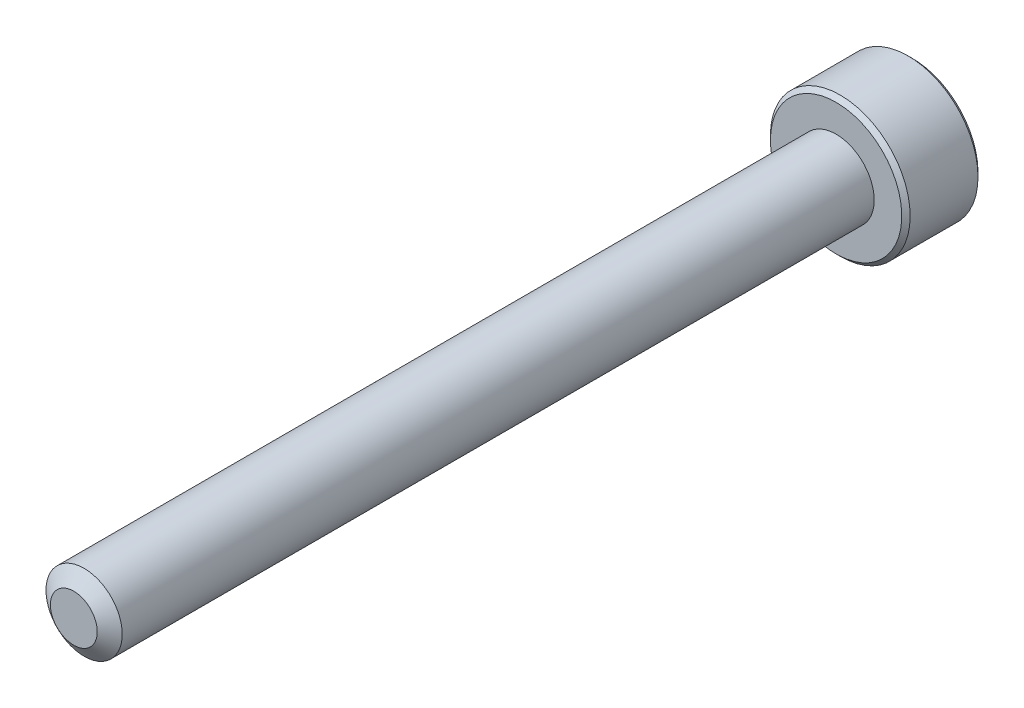
ISO-10303-21;
HEADER;
FILE_DESCRIPTION(('STEP AP214'),'2;1');
FILE_NAME('part.step','',(''),(''),'','','');
FILE_SCHEMA(('AUTOMOTIVE_DESIGN { 1 0 10303 214 1 1 1 1 }'));
ENDSEC;
DATA;
#1=APPLICATION_CONTEXT('core data for automotive mechanical design processes');
#2=APPLICATION_PROTOCOL_DEFINITION('international standard','automotive_design',2000,#1);
#3=PRODUCT_CONTEXT('',#1,'mechanical');
#4=PRODUCT('Part','Part','',(#3));
#5=PRODUCT_RELATED_PRODUCT_CATEGORY('part','',(#4));
#6=PRODUCT_DEFINITION_FORMATION('','',#4);
#7=PRODUCT_DEFINITION_CONTEXT('part definition',#1,'design');
#8=PRODUCT_DEFINITION('design','',#6,#7);
#9=PRODUCT_DEFINITION_SHAPE('','',#8);
#10=(LENGTH_UNIT() NAMED_UNIT(*) SI_UNIT(.MILLI.,.METRE.));
#11=(NAMED_UNIT(*) PLANE_ANGLE_UNIT() SI_UNIT($,.RADIAN.));
#12=(NAMED_UNIT(*) SI_UNIT($,.STERADIAN.) SOLID_ANGLE_UNIT());
#13=UNCERTAINTY_MEASURE_WITH_UNIT(LENGTH_MEASURE(1.E-05),#10,'distance_accuracy_value','');
#14=(GEOMETRIC_REPRESENTATION_CONTEXT(3) GLOBAL_UNCERTAINTY_ASSIGNED_CONTEXT((#13)) GLOBAL_UNIT_ASSIGNED_CONTEXT((#10,
#11,#12)) REPRESENTATION_CONTEXT('',''));
#15=CARTESIAN_POINT('',(0.,0.,0.));
#16=DIRECTION('',(0.,0.,1.));
#17=DIRECTION('',(1.,0.,0.));
#18=AXIS2_PLACEMENT_3D('',#15,#16,#17);
#19=CARTESIAN_POINT('',(0.,-1.44337567297406,-31.125));
#20=DIRECTION('',(-0.5,-0.866025403784439,0.));
#21=DIRECTION('',(0.866025403784439,-0.5,0.));
#22=AXIS2_PLACEMENT_3D('',#19,#20,#21);
#23=PLANE('',#22);
#24=CARTESIAN_POINT('',(-1.24999999999719,-0.721687836488653,-33.0000000000106));
#25=CARTESIAN_POINT('',(-1.20703689149334,-0.746492598748569,-32.9752190397288));
#26=CARTESIAN_POINT('',(-1.16335543595188,-0.771712098864028,-32.9518937494737));
#27=CARTESIAN_POINT('',(-1.07428446543455,-0.823137247669188,-32.9091861389212));
#28=CARTESIAN_POINT('',(-1.02888648443341,-0.849347784220863,-32.8898275733605));
#29=CARTESIAN_POINT('',(-0.937343688520915,-0.902200042083313,-32.8566662159147));
#30=CARTESIAN_POINT('',(-0.891222174140705,-0.928828310826161,-32.8427800967852));
#31=CARTESIAN_POINT('',(-0.79796403889092,-0.982670920316747,-32.8213859018018));
#32=CARTESIAN_POINT('',(-0.750830264933392,-1.00988361739905,-32.8138618619237));
#33=CARTESIAN_POINT('',(-0.669590913521733,-1.05678717880536,-32.8070728277984));
#34=CARTESIAN_POINT('',(-0.635590177984294,-1.07641751262055,-32.8060681886569));
#35=CARTESIAN_POINT('',(-0.567648554675317,-1.11564362712716,-32.8077634952234));
#36=CARTESIAN_POINT('',(-0.533707681782074,-1.13523939922861,-32.8104642592638));
#37=CARTESIAN_POINT('',(-0.466153619735585,-1.174241755136,-32.8194142483472));
#38=CARTESIAN_POINT('',(-0.432540764897262,-1.19364814592514,-32.8256667730595));
#39=CARTESIAN_POINT('',(-0.365876260757552,-1.23213691533559,-32.8413835392478));
#40=CARTESIAN_POINT('',(-0.332824858668373,-1.25121915122888,-32.8508491588607));
#41=CARTESIAN_POINT('',(-0.248213569936039,-1.30006950155497,-32.8789283315822));
#42=CARTESIAN_POINT('',(-0.197186124432403,-1.32953021095255,-32.8996493450655));
#43=CARTESIAN_POINT('',(-0.0971276056231052,-1.38729902372182,-32.9463235058209));
#44=CARTESIAN_POINT('',(-0.0480906425397016,-1.41561052755826,-32.9722596212326));
#45=CARTESIAN_POINT('',(-2.80957824535407E-12,-1.44337567297244,-33.0000000000106));
#46=B_SPLINE_CURVE_WITH_KNOTS('',3,(#24,#25,#26,#27,#28,#29,#30,#31,#32,#33,#34,#35,#36,#37,#38,
#39,#40,#41,#42,#43,#44,#45),.UNSPECIFIED.,.F.,.F.,(4,2,2,2,2,2,2,2,2,2,4),(0.,
0.166478683225078,0.333926926831281,0.498716658516144,0.663091654625516,0.780745575557468,
0.898425484350478,1.01621489976922,1.13405490052337,1.32111591641063,1.50757565757894),.UNSPECIFIED.);
#47=CARTESIAN_POINT('',(-1.25000000000136,-0.721687836486245,-33.0000000000131));
#48=VERTEX_POINT('',#47);
#49=CARTESIAN_POINT('',(-4.16671953249464E-12,-1.44337567297485,-33.0000000000131));
#50=VERTEX_POINT('',#49);
#51=EDGE_CURVE('E21',#48,#50,#46,.T.);
#52=ORIENTED_EDGE('',*,*,#51,.F.);
#53=DIRECTION('',(0.,0.,1.));
#54=VECTOR('',#53,1.);
#55=CARTESIAN_POINT('',(-1.25,-0.721687836487032,-31.125));
#56=LINE('',#55,#54);
#57=CARTESIAN_POINT('',(-1.25,-0.721687836487031,-31.125));
#58=VERTEX_POINT('',#57);
#59=EDGE_CURVE('E104',#48,#58,#56,.T.);
#60=ORIENTED_EDGE('',*,*,#59,.T.);
#61=DIRECTION('',(0.866025403784439,-0.5,0.));
#62=VECTOR('',#61,1.);
#63=CARTESIAN_POINT('',(0.,-1.44337567297406,-31.125));
#64=LINE('',#63,#62);
#65=CARTESIAN_POINT('',(0.,-1.44337567297406,-31.125));
#66=VERTEX_POINT('',#65);
#67=EDGE_CURVE('E77',#66,#58,#64,.F.);
#68=ORIENTED_EDGE('',*,*,#67,.F.);
#69=DIRECTION('',(0.,0.,1.));
#70=VECTOR('',#69,1.);
#71=CARTESIAN_POINT('',(0.,-1.44337567297406,-31.125));
#72=LINE('',#71,#70);
#73=EDGE_CURVE('E76',#66,#50,#72,.F.);
#74=ORIENTED_EDGE('',*,*,#73,.T.);
#75=EDGE_LOOP('',(#52,#60,#68,#74));
#76=FACE_BOUND('',#75,.T.);
#77=ADVANCED_FACE('F17',(#76),#23,.F.);
#78=CARTESIAN_POINT('',(1.25,-0.721687836487033,-31.125));
#79=DIRECTION('',(0.5,-0.866025403784439,0.));
#80=DIRECTION('',(0.866025403784439,0.5,0.));
#81=AXIS2_PLACEMENT_3D('',#78,#79,#80);
#82=PLANE('',#81);
#83=CARTESIAN_POINT('',(2.81411783743714E-12,-1.44337567297244,-33.0000000000106));
#84=CARTESIAN_POINT('',(0.0429631085066566,-1.41857091071252,-32.9752190397288));
#85=CARTESIAN_POINT('',(0.0866445640481205,-1.39335141059707,-32.9518937494737));
#86=CARTESIAN_POINT('',(0.175715534565449,-1.3419262617919,-32.9091861389212));
#87=CARTESIAN_POINT('',(0.221113515566591,-1.31571572524023,-32.8898275733605));
#88=CARTESIAN_POINT('',(0.312656311479088,-1.26286346737778,-32.8566662159147));
#89=CARTESIAN_POINT('',(0.358777825859299,-1.23623519863493,-32.8427800967852));
#90=CARTESIAN_POINT('',(0.452035961109083,-1.18239258914434,-32.8213859018018));
#91=CARTESIAN_POINT('',(0.49916973506661,-1.15517989206204,-32.8138618619237));
#92=CARTESIAN_POINT('',(0.58040908647827,-1.10827633065573,-32.8070728277984));
#93=CARTESIAN_POINT('',(0.614409822015708,-1.08864599684055,-32.8060681886569));
#94=CARTESIAN_POINT('',(0.682351445324686,-1.04941988233393,-32.8077634952234));
#95=CARTESIAN_POINT('',(0.716292318217928,-1.02982411023248,-32.8104642592638));
#96=CARTESIAN_POINT('',(0.783846380264418,-0.99082175432509,-32.8194142483472));
#97=CARTESIAN_POINT('',(0.817459235102742,-0.971415363535952,-32.8256667730595));
#98=CARTESIAN_POINT('',(0.884123739242452,-0.932926594125497,-32.8413835392478));
#99=CARTESIAN_POINT('',(0.91717514133163,-0.913844358232215,-32.8508491588607));
#100=CARTESIAN_POINT('',(1.00178643006396,-0.864994007906121,-32.8789283315822));
#101=CARTESIAN_POINT('',(1.0528138755676,-0.835533298508539,-32.8996493450655));
#102=CARTESIAN_POINT('',(1.15287239437689,-0.777764485739277,-32.9463235058209));
#103=CARTESIAN_POINT('',(1.2019093574603,-0.749452981902834,-32.9722596212326));
#104=CARTESIAN_POINT('',(1.24999999999719,-0.721687836488658,-33.0000000000106));
#105=B_SPLINE_CURVE_WITH_KNOTS('',3,(#83,#84,#85,#86,#87,#88,#89,#90,#91,#92,#93,#94,#95,#96,
#97,#98,#99,#100,#101,#102,#103,#104),.UNSPECIFIED.,.F.,.F.,(4,2,2,2,2,2,2,2,2,2,4),(0.,
0.166478683225079,0.333926926831284,0.498716658516146,0.663091654625518,0.78074557555747,
0.89842548435048,1.01621489976923,1.13405490052337,1.32111591641063,1.50757565757893),.UNSPECIFIED.);
#106=CARTESIAN_POINT('',(1.24999999999859,-0.721687836491034,-33.0000000000131));
#107=VERTEX_POINT('',#106);
#108=EDGE_CURVE('E84',#50,#107,#105,.T.);
#109=ORIENTED_EDGE('',*,*,#108,.F.);
#110=ORIENTED_EDGE('',*,*,#73,.F.);
#111=DIRECTION('',(-0.86602540378444,-0.499999999999997,0.));
#112=VECTOR('',#111,1.);
#113=CARTESIAN_POINT('',(1.25,-0.721687836487033,-31.125));
#114=LINE('',#113,#112);
#115=CARTESIAN_POINT('',(1.25,-0.721687836487033,-31.125));
#116=VERTEX_POINT('',#115);
#117=EDGE_CURVE('E272',#116,#66,#114,.T.);
#118=ORIENTED_EDGE('',*,*,#117,.F.);
#119=DIRECTION('',(0.,0.,-1.));
#120=VECTOR('',#119,1.);
#121=CARTESIAN_POINT('',(1.25,-0.721687836487033,-31.125));
#122=LINE('',#121,#120);
#123=EDGE_CURVE('E103',#116,#107,#122,.T.);
#124=ORIENTED_EDGE('',*,*,#123,.T.);
#125=EDGE_LOOP('',(#109,#110,#118,#124));
#126=FACE_BOUND('',#125,.T.);
#127=ADVANCED_FACE('F101',(#126),#82,.F.);
#128=CARTESIAN_POINT('',(-1.25,-0.721687836487032,-31.125));
#129=DIRECTION('',(-1.,0.,0.));
#130=DIRECTION('',(0.,-1.,0.));
#131=AXIS2_PLACEMENT_3D('',#128,#129,#130);
#132=PLANE('',#131);
#133=CARTESIAN_POINT('',(-1.25,0.721687836483783,-33.0000000000106));
#134=CARTESIAN_POINT('',(-1.25,0.672078311963948,-32.9752190397288));
#135=CARTESIAN_POINT('',(-1.25,0.621639311733029,-32.9518937494737));
#136=CARTESIAN_POINT('',(-1.25,0.518789014122708,-32.9091861389212));
#137=CARTESIAN_POINT('',(-1.25,0.46636794101936,-32.8898275733605));
#138=CARTESIAN_POINT('',(-1.25,0.360663425294459,-32.8566662159147));
#139=CARTESIAN_POINT('',(-1.25,0.307406887808763,-32.8427800967852));
#140=CARTESIAN_POINT('',(-1.25,0.199721668827592,-32.8213859018018));
#141=CARTESIAN_POINT('',(-1.25,0.145296274662989,-32.8138618619237));
#142=CARTESIAN_POINT('',(-1.25,0.0514891518503645,-32.8070728277984));
#143=CARTESIAN_POINT('',(-1.25,0.0122284842199936,-32.8060681886569));
#144=CARTESIAN_POINT('',(-1.25,-0.066223744793243,-32.8077634952234));
#145=CARTESIAN_POINT('',(-1.25,-0.105415288996132,-32.8104642592638));
#146=CARTESIAN_POINT('',(-1.25,-0.183420000810919,-32.8194142483472));
#147=CARTESIAN_POINT('',(-1.25,-0.222232782389194,-32.8256667730595));
#148=CARTESIAN_POINT('',(-1.25,-0.299210321210103,-32.8413835392478));
#149=CARTESIAN_POINT('',(-1.25,-0.337374792996667,-32.8508491588607));
#150=CARTESIAN_POINT('',(-1.25,-0.435075493648855,-32.8789283315822));
#151=CARTESIAN_POINT('',(-1.25,-0.493996912444021,-32.8996493450655));
#152=CARTESIAN_POINT('',(-1.25,-0.609534537982544,-32.9463235058209));
#153=CARTESIAN_POINT('',(-1.25,-0.666157545655431,-32.9722596212326));
#154=CARTESIAN_POINT('',(-1.25,-0.721687836483782,-33.0000000000106));
#155=B_SPLINE_CURVE_WITH_KNOTS('',3,(#133,#134,#135,#136,#137,#138,#139,#140,#141,#142,#143,
#144,#145,#146,#147,#148,#149,#150,#151,#152,#153,#154),.UNSPECIFIED.,.F.,.F.,(4,2,2,2,2,2,2,2,
2,2,4),(0.,0.166478683225082,0.333926926831283,0.498716658516146,0.663091654625519,
0.78074557555747,0.89842548435048,1.01621489976923,1.13405490052337,1.32111591641063,
1.50757565757893),.UNSPECIFIED.);
#156=CARTESIAN_POINT('',(-1.25,0.721687836488597,-33.0000000000131));
#157=VERTEX_POINT('',#156);
#158=EDGE_CURVE('E61',#157,#48,#155,.T.);
#159=ORIENTED_EDGE('',*,*,#158,.F.);
#160=DIRECTION('',(0.,0.,1.));
#161=VECTOR('',#160,1.);
#162=CARTESIAN_POINT('',(-1.25,0.721687836487032,-31.125));
#163=LINE('',#162,#161);
#164=CARTESIAN_POINT('',(-1.25,0.721687836487032,-31.125));
#165=VERTEX_POINT('',#164);
#166=EDGE_CURVE('E249',#157,#165,#163,.T.);
#167=ORIENTED_EDGE('',*,*,#166,.T.);
#168=DIRECTION('',(0.,1.,0.));
#169=VECTOR('',#168,1.);
#170=CARTESIAN_POINT('',(-1.25,2.1650635094611,-31.125));
#171=LINE('',#170,#169);
#172=EDGE_CURVE('E268',#58,#165,#171,.T.);
#173=ORIENTED_EDGE('',*,*,#172,.F.);
#174=ORIENTED_EDGE('',*,*,#59,.F.);
#175=EDGE_LOOP('',(#159,#167,#173,#174));
#176=FACE_BOUND('',#175,.T.);
#177=ADVANCED_FACE('F122',(#176),#132,.F.);
#178=CARTESIAN_POINT('',(1.25,2.1650635094611,-31.125));
#179=DIRECTION('',(0.,0.,-1.));
#180=DIRECTION('',(-1.,0.,0.));
#181=AXIS2_PLACEMENT_3D('',#178,#179,#180);
#182=PLANE('',#181);
#183=ORIENTED_EDGE('',*,*,#67,.T.);
#184=ORIENTED_EDGE('',*,*,#172,.T.);
#185=DIRECTION('',(-0.866025403784439,-0.5,0.));
#186=VECTOR('',#185,1.);
#187=CARTESIAN_POINT('',(-1.25,0.721687836487032,-31.125));
#188=LINE('',#187,#186);
#189=CARTESIAN_POINT('',(0.,1.44337567297406,-31.125));
#190=VERTEX_POINT('',#189);
#191=EDGE_CURVE('E144',#165,#190,#188,.F.);
#192=ORIENTED_EDGE('',*,*,#191,.T.);
#193=DIRECTION('',(-0.866025403784439,0.5,0.));
#194=VECTOR('',#193,1.);
#195=CARTESIAN_POINT('',(0.,1.44337567297406,-31.125));
#196=LINE('',#195,#194);
#197=CARTESIAN_POINT('',(1.25,0.721687836487029,-31.125));
#198=VERTEX_POINT('',#197);
#199=EDGE_CURVE('E246',#190,#198,#196,.F.);
#200=ORIENTED_EDGE('',*,*,#199,.T.);
#201=DIRECTION('',(0.,1.,0.));
#202=VECTOR('',#201,1.);
#203=CARTESIAN_POINT('',(1.25,0.721687836487032,-31.125));
#204=LINE('',#203,#202);
#205=EDGE_CURVE('E263',#198,#116,#204,.F.);
#206=ORIENTED_EDGE('',*,*,#205,.T.);
#207=ORIENTED_EDGE('',*,*,#117,.T.);
#208=EDGE_LOOP('',(#183,#184,#192,#200,#206,#207));
#209=FACE_BOUND('',#208,.T.);
#210=ADVANCED_FACE('F126',(#209),#182,.T.);
#211=CARTESIAN_POINT('',(1.25,0.721687836487032,-31.125));
#212=DIRECTION('',(1.,0.,0.));
#213=DIRECTION('',(0.,0.,-1.));
#214=AXIS2_PLACEMENT_3D('',#211,#212,#213);
#215=PLANE('',#214);
#216=CARTESIAN_POINT('',(1.25,-0.721687836483783,-33.0000000000106));
#217=CARTESIAN_POINT('',(1.25,-0.672078311963948,-32.9752190397288));
#218=CARTESIAN_POINT('',(1.25,-0.621639311733029,-32.9518937494737));
#219=CARTESIAN_POINT('',(1.25,-0.518789014122707,-32.9091861389212));
#220=CARTESIAN_POINT('',(1.25,-0.466367941019357,-32.8898275733605));
#221=CARTESIAN_POINT('',(1.25,-0.360663425294455,-32.8566662159147));
#222=CARTESIAN_POINT('',(1.25,-0.307406887808759,-32.8427800967852));
#223=CARTESIAN_POINT('',(1.25,-0.199721668827589,-32.8213859018018));
#224=CARTESIAN_POINT('',(1.25,-0.145296274662988,-32.8138618619237));
#225=CARTESIAN_POINT('',(1.25,-0.0514891518503652,-32.8070728277984));
#226=CARTESIAN_POINT('',(1.25,-0.0122284842199946,-32.8060681886569));
#227=CARTESIAN_POINT('',(1.25,0.0662237447932413,-32.8077634952234));
#228=CARTESIAN_POINT('',(1.25,0.10541528899613,-32.8104642592638));
#229=CARTESIAN_POINT('',(1.25,0.183420000810917,-32.8194142483472));
#230=CARTESIAN_POINT('',(1.25,0.222232782389193,-32.8256667730595));
#231=CARTESIAN_POINT('',(1.25,0.299210321210102,-32.8413835392478));
#232=CARTESIAN_POINT('',(1.25,0.337374792996666,-32.8508491588607));
#233=CARTESIAN_POINT('',(1.25,0.435075493649003,-32.8789283315822));
#234=CARTESIAN_POINT('',(1.25,0.493996912444312,-32.8996493450656));
#235=CARTESIAN_POINT('',(1.25,0.609534537983112,-32.9463235058211));
#236=CARTESIAN_POINT('',(1.25,0.666157545656132,-32.9722596212329));
#237=CARTESIAN_POINT('',(1.25,0.721687836484612,-33.0000000000111));
#238=B_SPLINE_CURVE_WITH_KNOTS('',3,(#216,#217,#218,#219,#220,#221,#222,#223,#224,#225,#226,
#227,#228,#229,#230,#231,#232,#233,#234,#235,#236,#237),.UNSPECIFIED.,.F.,.F.,(4,2,2,2,2,2,2,2,
2,2,4),(0.,0.166478683225082,0.333926926831288,0.498716658516149,0.663091654625518,
0.780745575557469,0.898425484350478,1.01621489976923,1.13405490052337,1.32111591641109,
1.50757565757986),.UNSPECIFIED.);
#239=CARTESIAN_POINT('',(1.25000000000033,0.721687836488433,-33.0000000000133));
#240=VERTEX_POINT('',#239);
#241=EDGE_CURVE('E40',#107,#240,#238,.T.);
#242=ORIENTED_EDGE('',*,*,#241,.F.);
#243=ORIENTED_EDGE('',*,*,#123,.F.);
#244=ORIENTED_EDGE('',*,*,#205,.F.);
#245=DIRECTION('',(0.,0.,1.));
#246=VECTOR('',#245,1.);
#247=CARTESIAN_POINT('',(1.25,0.721687836487029,-31.125));
#248=LINE('',#247,#246);
#249=EDGE_CURVE('E242',#198,#240,#248,.F.);
#250=ORIENTED_EDGE('',*,*,#249,.T.);
#251=EDGE_LOOP('',(#242,#243,#244,#250));
#252=FACE_BOUND('',#251,.T.);
#253=ADVANCED_FACE('F130',(#252),#215,.F.);
#254=CARTESIAN_POINT('',(-1.25,0.721687836487032,-31.125));
#255=DIRECTION('',(-0.5,0.866025403784439,0.));
#256=DIRECTION('',(-0.866025403784439,-0.5,0.));
#257=AXIS2_PLACEMENT_3D('',#254,#255,#256);
#258=PLANE('',#257);
#259=CARTESIAN_POINT('',(-2.09632003303961E-12,1.44337567297285,-33.0000000000111));
#260=CARTESIAN_POINT('',(-0.0429631085059828,1.41857091071291,-32.9752190397292));
#261=CARTESIAN_POINT('',(-0.0866445640474911,1.39335141059743,-32.9518937494741));
#262=CARTESIAN_POINT('',(-0.175715534564911,1.34192626179221,-32.9091861389215));
#263=CARTESIAN_POINT('',(-0.221113515566101,1.31571572524051,-32.8898275733607));
#264=CARTESIAN_POINT('',(-0.312656311478696,1.262863467378,-32.8566662159148));
#265=CARTESIAN_POINT('',(-0.358777825858958,1.23623519863513,-32.8427800967853));
#266=CARTESIAN_POINT('',(-0.452035961108846,1.18239258914448,-32.8213859018019));
#267=CARTESIAN_POINT('',(-0.499169735066427,1.15517989206215,-32.8138618619237));
#268=CARTESIAN_POINT('',(-0.580409086478143,1.1082763306558,-32.8070728277984));
#269=CARTESIAN_POINT('',(-0.614409822015584,1.08864599684062,-32.8060681886569));
#270=CARTESIAN_POINT('',(-0.682351445324567,1.049419882334,-32.8077634952234));
#271=CARTESIAN_POINT('',(-0.716292318217812,1.02982411023255,-32.8104642592638));
#272=CARTESIAN_POINT('',(-0.783846380264307,0.990821754325153,-32.8194142483471));
#273=CARTESIAN_POINT('',(-0.817459235102632,0.971415363536014,-32.8256667730595));
#274=CARTESIAN_POINT('',(-0.884123739242347,0.932926594125557,-32.8413835392478));
#275=CARTESIAN_POINT('',(-0.91717514133153,0.913844358232273,-32.8508491588607));
#276=CARTESIAN_POINT('',(-1.00178643006388,0.864994007906168,-32.8789283315821));
#277=CARTESIAN_POINT('',(-1.05281387556753,0.835533298508576,-32.8996493450654));
#278=CARTESIAN_POINT('',(-1.15287239437686,0.777764485739296,-32.9463235058209));
#279=CARTESIAN_POINT('',(-1.20190935746028,0.749452981902842,-32.9722596212326));
#280=CARTESIAN_POINT('',(-1.24999999999719,0.721687836488657,-33.0000000000106));
#281=B_SPLINE_CURVE_WITH_KNOTS('',3,(#259,#260,#261,#262,#263,#264,#265,#266,#267,#268,#269,
#270,#271,#272,#273,#274,#275,#276,#277,#278,#279,#280),.UNSPECIFIED.,.F.,.F.,(4,2,2,2,2,2,2,2,
2,2,4),(0.,0.166478683225274,0.333926926831679,0.498716658516734,0.663091654626296,
0.780745575558257,0.898425484351275,1.01621489977003,1.13405490052418,1.32111591641149,
1.50757565757986),.UNSPECIFIED.);
#282=CARTESIAN_POINT('',(-1.71900959987395E-12,1.44337567297505,-33.0000000000133));
#283=VERTEX_POINT('',#282);
#284=EDGE_CURVE('E145',#283,#157,#281,.T.);
#285=ORIENTED_EDGE('',*,*,#284,.F.);
#286=DIRECTION('',(0.,0.,1.));
#287=VECTOR('',#286,1.);
#288=CARTESIAN_POINT('',(0.,1.44337567297406,-31.125));
#289=LINE('',#288,#287);
#290=EDGE_CURVE('E170',#283,#190,#289,.T.);
#291=ORIENTED_EDGE('',*,*,#290,.T.);
#292=ORIENTED_EDGE('',*,*,#191,.F.);
#293=ORIENTED_EDGE('',*,*,#166,.F.);
#294=EDGE_LOOP('',(#285,#291,#292,#293));
#295=FACE_BOUND('',#294,.T.);
#296=ADVANCED_FACE('F135',(#295),#258,.F.);
#297=CARTESIAN_POINT('',(0.,1.44337567297406,-31.125));
#298=DIRECTION('',(0.5,0.866025403784439,0.));
#299=DIRECTION('',(-0.866025403784439,0.5,0.));
#300=AXIS2_PLACEMENT_3D('',#297,#298,#299);
#301=PLANE('',#300);
#302=CARTESIAN_POINT('',(2.09347186406145E-12,1.44337567297285,-33.0000000000111));
#303=CARTESIAN_POINT('',(0.042963108505979,1.41857091071291,-32.9752190397292));
#304=CARTESIAN_POINT('',(0.0866445640474883,1.39335141059743,-32.951893749474));
#305=CARTESIAN_POINT('',(0.175715534564911,1.34192626179221,-32.9091861389215));
#306=CARTESIAN_POINT('',(0.221113515566101,1.31571572524051,-32.8898275733607));
#307=CARTESIAN_POINT('',(0.312656311478697,1.262863467378,-32.8566662159148));
#308=CARTESIAN_POINT('',(0.358777825858957,1.23623519863512,-32.8427800967853));
#309=CARTESIAN_POINT('',(0.452035961108844,1.18239258914448,-32.8213859018019));
#310=CARTESIAN_POINT('',(0.499169735066425,1.15517989206215,-32.8138618619237));
#311=CARTESIAN_POINT('',(0.58040908647814,1.1082763306558,-32.8070728277984));
#312=CARTESIAN_POINT('',(0.614409822015581,1.08864599684061,-32.8060681886569));
#313=CARTESIAN_POINT('',(0.682351445324563,1.04941988233399,-32.8077634952234));
#314=CARTESIAN_POINT('',(0.716292318217808,1.02982411023255,-32.8104642592638));
#315=CARTESIAN_POINT('',(0.783846380264303,0.990821754325151,-32.8194142483471));
#316=CARTESIAN_POINT('',(0.81745923510263,0.971415363536012,-32.8256667730595));
#317=CARTESIAN_POINT('',(0.884123739242345,0.932926594125554,-32.8413835392478));
#318=CARTESIAN_POINT('',(0.917175141331527,0.91384435823227,-32.8508491588607));
#319=CARTESIAN_POINT('',(1.00178643006401,0.864994007906091,-32.8789283315822));
#320=CARTESIAN_POINT('',(1.05281387556778,0.835533298508428,-32.8996493450656));
#321=CARTESIAN_POINT('',(1.15287239437735,0.777764485739009,-32.9463235058211));
#322=CARTESIAN_POINT('',(1.20190935746088,0.749452981902489,-32.9722596212329));
#323=CARTESIAN_POINT('',(1.2499999999979,0.72168783648824,-33.0000000000111));
#324=B_SPLINE_CURVE_WITH_KNOTS('',3,(#302,#303,#304,#305,#306,#307,#308,#309,#310,#311,#312,
#313,#314,#315,#316,#317,#318,#319,#320,#321,#322,#323),.UNSPECIFIED.,.F.,.F.,(4,2,2,2,2,2,2,2,
2,2,4),(0.,0.166478683225279,0.333926926831683,0.498716658516736,0.663091654626297,
0.780745575558257,0.898425484351274,1.01621489977003,1.13405490052418,1.32111591641196,
1.50757565758079),.UNSPECIFIED.);
#325=EDGE_CURVE('E162',#283,#240,#324,.T.);
#326=ORIENTED_EDGE('',*,*,#325,.T.);
#327=ORIENTED_EDGE('',*,*,#249,.F.);
#328=ORIENTED_EDGE('',*,*,#199,.F.);
#329=ORIENTED_EDGE('',*,*,#290,.F.);
#330=EDGE_LOOP('',(#326,#327,#328,#329));
#331=FACE_BOUND('',#330,.T.);
#332=ADVANCED_FACE('F172',(#331),#301,.F.);
#333=CARTESIAN_POINT('',(0.,0.,-32.9999999999586));
#334=DIRECTION('',(0.,0.,-1.));
#335=DIRECTION('',(-1.,0.,0.));
#336=AXIS2_PLACEMENT_3D('',#333,#334,#335);
#337=CONICAL_SURFACE('',#336,1.44337567292041,0.785398163397448);
#338=ORIENTED_EDGE('',*,*,#284,.T.);
#339=CARTESIAN_POINT('',(0.,0.,-33.0000000000155));
#340=DIRECTION('',(0.,0.,-1.));
#341=DIRECTION('',(-1.,0.,0.));
#342=AXIS2_PLACEMENT_3D('',#339,#340,#341);
#343=CIRCLE('',#342,1.44337567297725);
#344=EDGE_CURVE('E169',#283,#157,#343,.F.);
#345=ORIENTED_EDGE('',*,*,#344,.F.);
#346=EDGE_LOOP('',(#338,#345));
#347=FACE_BOUND('',#346,.T.);
#348=ADVANCED_FACE('F175',(#347),#337,.F.);
#349=CARTESIAN_POINT('',(0.,0.,-32.9999999999586));
#350=DIRECTION('',(0.,0.,-1.));
#351=DIRECTION('',(-1.,0.,0.));
#352=AXIS2_PLACEMENT_3D('',#349,#350,#351);
#353=CONICAL_SURFACE('',#352,1.44337567292041,0.785398163397448);
#354=CARTESIAN_POINT('',(0.,0.,-33.0000000000155));
#355=DIRECTION('',(0.,0.,-1.));
#356=DIRECTION('',(-1.,0.,0.));
#357=AXIS2_PLACEMENT_3D('',#354,#355,#356);
#358=CIRCLE('',#357,1.44337567297725);
#359=EDGE_CURVE('E94',#157,#48,#358,.F.);
#360=ORIENTED_EDGE('',*,*,#359,.F.);
#361=ORIENTED_EDGE('',*,*,#158,.T.);
#362=EDGE_LOOP('',(#360,#361));
#363=FACE_BOUND('',#362,.T.);
#364=ADVANCED_FACE('F179',(#363),#353,.F.);
#365=CARTESIAN_POINT('',(0.,0.,-32.9999999999586));
#366=DIRECTION('',(0.,0.,-1.));
#367=DIRECTION('',(-1.,0.,0.));
#368=AXIS2_PLACEMENT_3D('',#365,#366,#367);
#369=CONICAL_SURFACE('',#368,1.44337567292041,0.785398163397448);
#370=ORIENTED_EDGE('',*,*,#51,.T.);
#371=CARTESIAN_POINT('',(0.,0.,-33.0000000000155));
#372=DIRECTION('',(0.,0.,-1.));
#373=DIRECTION('',(-1.,0.,0.));
#374=AXIS2_PLACEMENT_3D('',#371,#372,#373);
#375=CIRCLE('',#374,1.44337567297725);
#376=EDGE_CURVE('E72',#48,#50,#375,.F.);
#377=ORIENTED_EDGE('',*,*,#376,.F.);
#378=EDGE_LOOP('',(#370,#377));
#379=FACE_BOUND('',#378,.T.);
#380=ADVANCED_FACE('F70',(#379),#369,.F.);
#381=CARTESIAN_POINT('',(0.,0.,-32.9999999999586));
#382=DIRECTION('',(0.,0.,-1.));
#383=DIRECTION('',(-1.,0.,0.));
#384=AXIS2_PLACEMENT_3D('',#381,#382,#383);
#385=CONICAL_SURFACE('',#384,1.44337567292041,0.785398163397448);
#386=ORIENTED_EDGE('',*,*,#108,.T.);
#387=CARTESIAN_POINT('',(0.,0.,-33.0000000000155));
#388=DIRECTION('',(0.,0.,-1.));
#389=DIRECTION('',(-1.,0.,0.));
#390=AXIS2_PLACEMENT_3D('',#387,#388,#389);
#391=CIRCLE('',#390,1.44337567297725);
#392=EDGE_CURVE('E92',#50,#107,#391,.F.);
#393=ORIENTED_EDGE('',*,*,#392,.F.);
#394=EDGE_LOOP('',(#386,#393));
#395=FACE_BOUND('',#394,.T.);
#396=ADVANCED_FACE('F97',(#395),#385,.F.);
#397=CARTESIAN_POINT('',(0.,0.,-32.9999999999586));
#398=DIRECTION('',(0.,0.,-1.));
#399=DIRECTION('',(-1.,0.,0.));
#400=AXIS2_PLACEMENT_3D('',#397,#398,#399);
#401=CONICAL_SURFACE('',#400,1.44337567292041,0.785398163397448);
#402=ORIENTED_EDGE('',*,*,#241,.T.);
#403=CARTESIAN_POINT('',(0.,0.,-33.0000000000155));
#404=DIRECTION('',(0.,0.,-1.));
#405=DIRECTION('',(-1.,0.,0.));
#406=AXIS2_PLACEMENT_3D('',#403,#404,#405);
#407=CIRCLE('',#406,1.44337567297725);
#408=EDGE_CURVE('E99',#107,#240,#407,.F.);
#409=ORIENTED_EDGE('',*,*,#408,.F.);
#410=EDGE_LOOP('',(#402,#409));
#411=FACE_BOUND('',#410,.T.);
#412=ADVANCED_FACE('F152',(#411),#401,.F.);
#413=CARTESIAN_POINT('',(0.,0.,-32.9999999999586));
#414=DIRECTION('',(0.,0.,-1.));
#415=DIRECTION('',(-1.,0.,0.));
#416=AXIS2_PLACEMENT_3D('',#413,#414,#415);
#417=CONICAL_SURFACE('',#416,1.44337567292041,0.785398163397448);
#418=ORIENTED_EDGE('',*,*,#325,.F.);
#419=CARTESIAN_POINT('',(0.,0.,-33.0000000000155));
#420=DIRECTION('',(0.,0.,-1.));
#421=DIRECTION('',(-1.,0.,0.));
#422=AXIS2_PLACEMENT_3D('',#419,#420,#421);
#423=CIRCLE('',#422,1.44337567297725);
#424=EDGE_CURVE('E234',#240,#283,#423,.F.);
#425=ORIENTED_EDGE('',*,*,#424,.F.);
#426=EDGE_LOOP('',(#418,#425));
#427=FACE_BOUND('',#426,.T.);
#428=ADVANCED_FACE('F156',(#427),#417,.F.);
#429=CARTESIAN_POINT('',(0.,0.,-33.));
#430=DIRECTION('',(0.,0.,-1.));
#431=DIRECTION('',(-1.,0.,0.));
#432=AXIS2_PLACEMENT_3D('',#429,#430,#431);
#433=PLANE('',#432);
#434=ORIENTED_EDGE('',*,*,#408,.T.);
#435=ORIENTED_EDGE('',*,*,#424,.T.);
#436=ORIENTED_EDGE('',*,*,#344,.T.);
#437=ORIENTED_EDGE('',*,*,#359,.T.);
#438=ORIENTED_EDGE('',*,*,#376,.T.);
#439=ORIENTED_EDGE('',*,*,#392,.T.);
#440=EDGE_LOOP('',(#434,#435,#436,#437,#438,#439));
#441=FACE_BOUND('',#440,.T.);
#442=CARTESIAN_POINT('',(0.,0.,-33.0000000000723));
#443=DIRECTION('',(0.,0.,1.));
#444=DIRECTION('',(1.,0.,0.));
#445=AXIS2_PLACEMENT_3D('',#442,#443,#444);
#446=CIRCLE('',#445,2.5850000000105);
#447=CARTESIAN_POINT('',(2.5850000000105,0.,-33.0000000000723));
#448=VERTEX_POINT('',#447);
#449=EDGE_CURVE('E225',#448,#448,#446,.T.);
#450=ORIENTED_EDGE('',*,*,#449,.F.);
#451=EDGE_LOOP('',(#450));
#452=FACE_BOUND('',#451,.T.);
#453=ADVANCED_FACE('F90',(#441,#452),#433,.T.);
#454=CARTESIAN_POINT('',(0.,0.,-32.8350000000341));
#455=DIRECTION('',(0.,0.,1.));
#456=DIRECTION('',(1.,0.,0.));
#457=AXIS2_PLACEMENT_3D('',#454,#455,#456);
#458=CONICAL_SURFACE('',#457,2.7500000001055,0.785398163569701);
#459=ORIENTED_EDGE('',*,*,#449,.T.);
#460=EDGE_LOOP('',(#459));
#461=FACE_BOUND('',#460,.T.);
#462=CARTESIAN_POINT('',(0.,0.,-32.835));
#463=DIRECTION('',(0.,0.,1.));
#464=DIRECTION('',(1.,0.,0.));
#465=AXIS2_PLACEMENT_3D('',#462,#463,#464);
#466=CIRCLE('',#465,2.75);
#467=CARTESIAN_POINT('',(2.75,0.,-32.835));
#468=VERTEX_POINT('',#467);
#469=EDGE_CURVE('E228',#468,#468,#466,.T.);
#470=ORIENTED_EDGE('',*,*,#469,.F.);
#471=EDGE_LOOP('',(#470));
#472=FACE_BOUND('',#471,.T.);
#473=ADVANCED_FACE('F215',(#461,#472),#458,.T.);
#474=CARTESIAN_POINT('',(0.,0.,-33.));
#475=DIRECTION('',(0.,0.,1.));
#476=DIRECTION('',(1.,0.,0.));
#477=AXIS2_PLACEMENT_3D('',#474,#475,#476);
#478=CYLINDRICAL_SURFACE('',#477,2.75);
#479=ORIENTED_EDGE('',*,*,#469,.T.);
#480=EDGE_LOOP('',(#479));
#481=FACE_BOUND('',#480,.T.);
#482=CARTESIAN_POINT('',(0.,0.,-30.1650000000109));
#483=DIRECTION('',(0.,0.,-1.));
#484=DIRECTION('',(-1.,0.,0.));
#485=AXIS2_PLACEMENT_3D('',#482,#483,#484);
#486=CIRCLE('',#485,2.74999999999181);
#487=CARTESIAN_POINT('',(-2.74999999999181,0.,-30.1650000000109));
#488=VERTEX_POINT('',#487);
#489=EDGE_CURVE('E229',#488,#488,#486,.F.);
#490=ORIENTED_EDGE('',*,*,#489,.F.);
#491=EDGE_LOOP('',(#490));
#492=FACE_BOUND('',#491,.T.);
#493=ADVANCED_FACE('F212',(#481,#492),#478,.T.);
#494=CARTESIAN_POINT('',(0.,0.,0.));
#495=DIRECTION('',(0.,0.,1.));
#496=DIRECTION('',(1.,0.,0.));
#497=AXIS2_PLACEMENT_3D('',#494,#495,#496);
#498=PLANE('',#497);
#499=CARTESIAN_POINT('',(0.,0.,5.6843418860808E-11));
#500=DIRECTION('',(0.,0.,-1.));
#501=DIRECTION('',(-1.,0.,0.));
#502=AXIS2_PLACEMENT_3D('',#499,#500,#501);
#503=CIRCLE('',#502,0.921240473587659);
#504=CARTESIAN_POINT('',(-0.921240473587659,0.,5.6843418860808E-11));
#505=VERTEX_POINT('',#504);
#506=EDGE_CURVE('E232',#505,#505,#503,.T.);
#507=ORIENTED_EDGE('',*,*,#506,.F.);
#508=EDGE_LOOP('',(#507));
#509=FACE_BOUND('',#508,.T.);
#510=ADVANCED_FACE('F208',(#509),#498,.T.);
#511=CARTESIAN_POINT('',(0.,0.,-30.1649999998972));
#512=DIRECTION('',(0.,0.,-1.));
#513=DIRECTION('',(-1.,0.,0.));
#514=AXIS2_PLACEMENT_3D('',#511,#512,#513);
#515=CONICAL_SURFACE('',#514,2.74999999993497,0.785398163569701);
#516=CARTESIAN_POINT('',(0.,0.,-30.0000000000296));
#517=DIRECTION('',(0.,0.,-1.));
#518=DIRECTION('',(-1.,0.,0.));
#519=AXIS2_PLACEMENT_3D('',#516,#517,#518);
#520=CIRCLE('',#519,2.5850000000105);
#521=CARTESIAN_POINT('',(-2.5850000000105,0.,-30.0000000000296));
#522=VERTEX_POINT('',#521);
#523=EDGE_CURVE('E287',#522,#522,#520,.T.);
#524=ORIENTED_EDGE('',*,*,#523,.T.);
#525=EDGE_LOOP('',(#524));
#526=FACE_BOUND('',#525,.T.);
#527=ORIENTED_EDGE('',*,*,#489,.T.);
#528=EDGE_LOOP('',(#527));
#529=FACE_BOUND('',#528,.T.);
#530=ADVANCED_FACE('F204',(#526,#529),#515,.T.);
#531=CARTESIAN_POINT('',(0.,0.,-0.405251783149652));
#532=DIRECTION('',(0.,0.,-1.));
#533=DIRECTION('',(-1.,0.,0.));
#534=AXIS2_PLACEMENT_3D('',#531,#532,#533);
#535=CONICAL_SURFACE('',#534,1.50000000002137,0.959931088612039);
#536=ORIENTED_EDGE('',*,*,#506,.T.);
#537=EDGE_LOOP('',(#536));
#538=FACE_BOUND('',#537,.T.);
#539=CARTESIAN_POINT('',(0.,0.,-0.405251783209382));
#540=DIRECTION('',(0.,0.,1.));
#541=DIRECTION('',(1.,0.,0.));
#542=AXIS2_PLACEMENT_3D('',#539,#540,#541);
#543=CIRCLE('',#542,1.5);
#544=CARTESIAN_POINT('',(1.5,0.,-0.405251783209382));
#545=VERTEX_POINT('',#544);
#546=EDGE_CURVE('E32',#545,#545,#543,.F.);
#547=ORIENTED_EDGE('',*,*,#546,.F.);
#548=EDGE_LOOP('',(#547));
#549=FACE_BOUND('',#548,.T.);
#550=ADVANCED_FACE('F197',(#538,#549),#535,.T.);
#551=CARTESIAN_POINT('',(0.,0.,-30.));
#552=DIRECTION('',(0.,0.,-1.));
#553=DIRECTION('',(-1.,0.,0.));
#554=AXIS2_PLACEMENT_3D('',#551,#552,#553);
#555=PLANE('',#554);
#556=CARTESIAN_POINT('',(0.,0.,-30.));
#557=DIRECTION('',(0.,0.,1.));
#558=DIRECTION('',(1.,0.,0.));
#559=AXIS2_PLACEMENT_3D('',#556,#557,#558);
#560=CIRCLE('',#559,1.5);
#561=CARTESIAN_POINT('',(1.5,0.,-30.));
#562=VERTEX_POINT('',#561);
#563=EDGE_CURVE('E11',#562,#562,#560,.T.);
#564=ORIENTED_EDGE('',*,*,#563,.F.);
#565=EDGE_LOOP('',(#564));
#566=FACE_BOUND('',#565,.T.);
#567=ORIENTED_EDGE('',*,*,#523,.F.);
#568=EDGE_LOOP('',(#567));
#569=FACE_BOUND('',#568,.T.);
#570=ADVANCED_FACE('F191',(#566,#569),#555,.F.);
#571=CARTESIAN_POINT('',(0.,0.,-30.));
#572=DIRECTION('',(0.,0.,1.));
#573=DIRECTION('',(1.,0.,0.));
#574=AXIS2_PLACEMENT_3D('',#571,#572,#573);
#575=CYLINDRICAL_SURFACE('',#574,1.5);
#576=ORIENTED_EDGE('',*,*,#563,.T.);
#577=EDGE_LOOP('',(#576));
#578=FACE_BOUND('',#577,.T.);
#579=ORIENTED_EDGE('',*,*,#546,.T.);
#580=EDGE_LOOP('',(#579));
#581=FACE_BOUND('',#580,.T.);
#582=ADVANCED_FACE('F189',(#578,#581),#575,.T.);
#583=CLOSED_SHELL('',(#77,#127,#177,#210,#253,#296,#332,#348,#364,#380,#396,#412,#428,#453,#473,
#493,#510,#530,#550,#570,#582));
#584=MANIFOLD_SOLID_BREP('B1',#583);
#585=ADVANCED_BREP_SHAPE_REPRESENTATION('',(#18,#584),#14);
#586=SHAPE_DEFINITION_REPRESENTATION(#9,#585);
ENDSEC;
END-ISO-10303-21;
